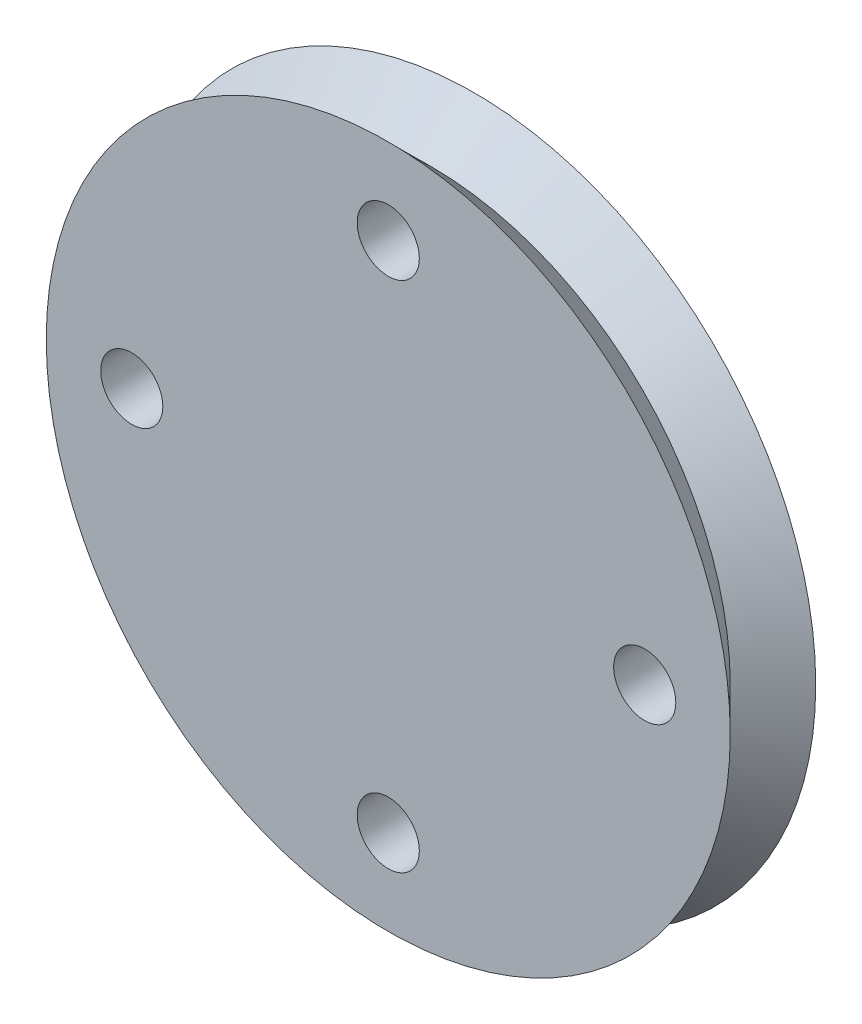
ISO-10303-21;
HEADER;
FILE_DESCRIPTION(('STEP AP214'),'2;1');
FILE_NAME('part.step','',(''),(''),'','','');
FILE_SCHEMA(('AUTOMOTIVE_DESIGN { 1 0 10303 214 1 1 1 1 }'));
ENDSEC;
DATA;
#1=APPLICATION_CONTEXT('core data for automotive mechanical design processes');
#2=APPLICATION_PROTOCOL_DEFINITION('international standard','automotive_design',2000,#1);
#3=PRODUCT_CONTEXT('',#1,'mechanical');
#4=PRODUCT('Part','Part','',(#3));
#5=PRODUCT_RELATED_PRODUCT_CATEGORY('part','',(#4));
#6=PRODUCT_DEFINITION_FORMATION('','',#4);
#7=PRODUCT_DEFINITION_CONTEXT('part definition',#1,'design');
#8=PRODUCT_DEFINITION('design','',#6,#7);
#9=PRODUCT_DEFINITION_SHAPE('','',#8);
#10=(LENGTH_UNIT() NAMED_UNIT(*) SI_UNIT(.MILLI.,.METRE.));
#11=(NAMED_UNIT(*) PLANE_ANGLE_UNIT() SI_UNIT($,.RADIAN.));
#12=(NAMED_UNIT(*) SI_UNIT($,.STERADIAN.) SOLID_ANGLE_UNIT());
#13=UNCERTAINTY_MEASURE_WITH_UNIT(LENGTH_MEASURE(1.E-05),#10,'distance_accuracy_value','');
#14=(GEOMETRIC_REPRESENTATION_CONTEXT(3) GLOBAL_UNCERTAINTY_ASSIGNED_CONTEXT((#13)) GLOBAL_UNIT_ASSIGNED_CONTEXT((#10,
#11,#12)) REPRESENTATION_CONTEXT('',''));
#15=CARTESIAN_POINT('',(0.,0.,0.));
#16=DIRECTION('',(0.,0.,1.));
#17=DIRECTION('',(1.,0.,0.));
#18=AXIS2_PLACEMENT_3D('',#15,#16,#17);
#19=CARTESIAN_POINT('',(0.,0.,2.));
#20=DIRECTION('',(0.,0.,1.));
#21=DIRECTION('',(1.,0.,0.));
#22=AXIS2_PLACEMENT_3D('',#19,#20,#21);
#23=PLANE('',#22);
#24=CARTESIAN_POINT('',(-6.,0.,2.));
#25=DIRECTION('',(0.,0.,1.));
#26=DIRECTION('',(1.,0.,0.));
#27=AXIS2_PLACEMENT_3D('',#24,#25,#26);
#28=CIRCLE('',#27,0.726422571278005);
#29=CARTESIAN_POINT('',(-5.27357742872199,0.,2.));
#30=VERTEX_POINT('',#29);
#31=EDGE_CURVE('E10',#30,#30,#28,.T.);
#32=ORIENTED_EDGE('',*,*,#31,.F.);
#33=EDGE_LOOP('',(#32));
#34=FACE_BOUND('',#33,.T.);
#35=CARTESIAN_POINT('',(0.,6.,2.));
#36=DIRECTION('',(0.,0.,1.));
#37=DIRECTION('',(1.,0.,0.));
#38=AXIS2_PLACEMENT_3D('',#35,#36,#37);
#39=CIRCLE('',#38,0.726422571278005);
#40=CARTESIAN_POINT('',(0.726422571278005,6.,2.));
#41=VERTEX_POINT('',#40);
#42=EDGE_CURVE('E46',#41,#41,#39,.T.);
#43=ORIENTED_EDGE('',*,*,#42,.F.);
#44=EDGE_LOOP('',(#43));
#45=FACE_BOUND('',#44,.T.);
#46=CARTESIAN_POINT('',(6.,0.,2.));
#47=DIRECTION('',(0.,0.,1.));
#48=DIRECTION('',(1.,0.,0.));
#49=AXIS2_PLACEMENT_3D('',#46,#47,#48);
#50=CIRCLE('',#49,0.726422571278005);
#51=CARTESIAN_POINT('',(6.72642257127801,0.,2.));
#52=VERTEX_POINT('',#51);
#53=EDGE_CURVE('E53',#52,#52,#50,.T.);
#54=ORIENTED_EDGE('',*,*,#53,.F.);
#55=EDGE_LOOP('',(#54));
#56=FACE_BOUND('',#55,.T.);
#57=CARTESIAN_POINT('',(0.,-6.,2.));
#58=DIRECTION('',(0.,0.,1.));
#59=DIRECTION('',(1.,0.,0.));
#60=AXIS2_PLACEMENT_3D('',#57,#58,#59);
#61=CIRCLE('',#60,0.726422571278006);
#62=CARTESIAN_POINT('',(0.726422571278009,-6.,2.));
#63=VERTEX_POINT('',#62);
#64=EDGE_CURVE('E37',#63,#63,#61,.T.);
#65=ORIENTED_EDGE('',*,*,#64,.F.);
#66=EDGE_LOOP('',(#65));
#67=FACE_BOUND('',#66,.T.);
#68=CARTESIAN_POINT('',(0.,0.,2.));
#69=DIRECTION('',(0.,0.,1.));
#70=DIRECTION('',(1.,0.,0.));
#71=AXIS2_PLACEMENT_3D('',#68,#69,#70);
#72=CIRCLE('',#71,8.);
#73=CARTESIAN_POINT('',(8.,0.,2.));
#74=VERTEX_POINT('',#73);
#75=EDGE_CURVE('E62',#74,#74,#72,.T.);
#76=ORIENTED_EDGE('',*,*,#75,.T.);
#77=EDGE_LOOP('',(#76));
#78=FACE_BOUND('',#77,.T.);
#79=ADVANCED_FACE('F33',(#34,#45,#56,#67,#78),#23,.T.);
#80=CARTESIAN_POINT('',(0.,0.,0.));
#81=DIRECTION('',(0.,0.,1.));
#82=DIRECTION('',(1.,0.,0.));
#83=AXIS2_PLACEMENT_3D('',#80,#81,#82);
#84=PLANE('',#83);
#85=CARTESIAN_POINT('',(-6.,0.,0.));
#86=DIRECTION('',(0.,0.,1.));
#87=DIRECTION('',(1.,0.,0.));
#88=AXIS2_PLACEMENT_3D('',#85,#86,#87);
#89=CIRCLE('',#88,0.726422571278005);
#90=CARTESIAN_POINT('',(-5.27357742872199,0.,0.));
#91=VERTEX_POINT('',#90);
#92=EDGE_CURVE('E41',#91,#91,#89,.T.);
#93=ORIENTED_EDGE('',*,*,#92,.T.);
#94=EDGE_LOOP('',(#93));
#95=FACE_BOUND('',#94,.T.);
#96=CARTESIAN_POINT('',(0.,6.,0.));
#97=DIRECTION('',(0.,0.,1.));
#98=DIRECTION('',(1.,0.,0.));
#99=AXIS2_PLACEMENT_3D('',#96,#97,#98);
#100=CIRCLE('',#99,0.726422571278005);
#101=CARTESIAN_POINT('',(0.726422571278005,6.,0.));
#102=VERTEX_POINT('',#101);
#103=EDGE_CURVE('E50',#102,#102,#100,.T.);
#104=ORIENTED_EDGE('',*,*,#103,.T.);
#105=EDGE_LOOP('',(#104));
#106=FACE_BOUND('',#105,.T.);
#107=CARTESIAN_POINT('',(6.,0.,0.));
#108=DIRECTION('',(0.,0.,1.));
#109=DIRECTION('',(1.,0.,0.));
#110=AXIS2_PLACEMENT_3D('',#107,#108,#109);
#111=CIRCLE('',#110,0.726422571278005);
#112=CARTESIAN_POINT('',(6.72642257127801,0.,0.));
#113=VERTEX_POINT('',#112);
#114=EDGE_CURVE('E56',#113,#113,#111,.T.);
#115=ORIENTED_EDGE('',*,*,#114,.T.);
#116=EDGE_LOOP('',(#115));
#117=FACE_BOUND('',#116,.T.);
#118=CARTESIAN_POINT('',(0.,-6.,0.));
#119=DIRECTION('',(0.,0.,1.));
#120=DIRECTION('',(1.,0.,0.));
#121=AXIS2_PLACEMENT_3D('',#118,#119,#120);
#122=CIRCLE('',#121,0.726422571278006);
#123=CARTESIAN_POINT('',(0.726422571278009,-6.,0.));
#124=VERTEX_POINT('',#123);
#125=EDGE_CURVE('E60',#124,#124,#122,.T.);
#126=ORIENTED_EDGE('',*,*,#125,.T.);
#127=EDGE_LOOP('',(#126));
#128=FACE_BOUND('',#127,.T.);
#129=CARTESIAN_POINT('',(0.,0.,0.));
#130=DIRECTION('',(0.,0.,1.));
#131=DIRECTION('',(1.,0.,0.));
#132=AXIS2_PLACEMENT_3D('',#129,#130,#131);
#133=CIRCLE('',#132,8.);
#134=CARTESIAN_POINT('',(8.,0.,0.));
#135=VERTEX_POINT('',#134);
#136=EDGE_CURVE('E71',#135,#135,#133,.T.);
#137=ORIENTED_EDGE('',*,*,#136,.F.);
#138=EDGE_LOOP('',(#137));
#139=FACE_BOUND('',#138,.T.);
#140=ADVANCED_FACE('F35',(#95,#106,#117,#128,#139),#84,.F.);
#141=CARTESIAN_POINT('',(0.,-6.,4.05463330463058));
#142=DIRECTION('',(0.,0.,-1.));
#143=DIRECTION('',(-1.,0.,0.));
#144=AXIS2_PLACEMENT_3D('',#141,#142,#143);
#145=CYLINDRICAL_SURFACE('',#144,0.726422571278006);
#146=ORIENTED_EDGE('',*,*,#125,.F.);
#147=EDGE_LOOP('',(#146));
#148=FACE_BOUND('',#147,.T.);
#149=ORIENTED_EDGE('',*,*,#64,.T.);
#150=EDGE_LOOP('',(#149));
#151=FACE_BOUND('',#150,.T.);
#152=ADVANCED_FACE('F81',(#148,#151),#145,.F.);
#153=CARTESIAN_POINT('',(6.,0.,4.05463330463058));
#154=DIRECTION('',(0.,0.,-1.));
#155=DIRECTION('',(-1.,0.,0.));
#156=AXIS2_PLACEMENT_3D('',#153,#154,#155);
#157=CYLINDRICAL_SURFACE('',#156,0.726422571278005);
#158=ORIENTED_EDGE('',*,*,#114,.F.);
#159=EDGE_LOOP('',(#158));
#160=FACE_BOUND('',#159,.T.);
#161=ORIENTED_EDGE('',*,*,#53,.T.);
#162=EDGE_LOOP('',(#161));
#163=FACE_BOUND('',#162,.T.);
#164=ADVANCED_FACE('F87',(#160,#163),#157,.F.);
#165=CARTESIAN_POINT('',(0.,6.,4.05463330463058));
#166=DIRECTION('',(0.,0.,-1.));
#167=DIRECTION('',(-1.,0.,0.));
#168=AXIS2_PLACEMENT_3D('',#165,#166,#167);
#169=CYLINDRICAL_SURFACE('',#168,0.726422571278005);
#170=ORIENTED_EDGE('',*,*,#103,.F.);
#171=EDGE_LOOP('',(#170));
#172=FACE_BOUND('',#171,.T.);
#173=ORIENTED_EDGE('',*,*,#42,.T.);
#174=EDGE_LOOP('',(#173));
#175=FACE_BOUND('',#174,.T.);
#176=ADVANCED_FACE('F99',(#172,#175),#169,.F.);
#177=CARTESIAN_POINT('',(-6.,0.,4.05463330463058));
#178=DIRECTION('',(0.,0.,-1.));
#179=DIRECTION('',(-1.,0.,0.));
#180=AXIS2_PLACEMENT_3D('',#177,#178,#179);
#181=CYLINDRICAL_SURFACE('',#180,0.726422571278005);
#182=ORIENTED_EDGE('',*,*,#92,.F.);
#183=EDGE_LOOP('',(#182));
#184=FACE_BOUND('',#183,.T.);
#185=ORIENTED_EDGE('',*,*,#31,.T.);
#186=EDGE_LOOP('',(#185));
#187=FACE_BOUND('',#186,.T.);
#188=ADVANCED_FACE('F109',(#184,#187),#181,.F.);
#189=CARTESIAN_POINT('',(0.,0.,2.));
#190=DIRECTION('',(0.,0.,1.));
#191=DIRECTION('',(1.,0.,0.));
#192=AXIS2_PLACEMENT_3D('',#189,#190,#191);
#193=CONICAL_SURFACE('',#192,8.,0.785398163397448);
#194=CARTESIAN_POINT('',(0.,0.,0.999999999999997));
#195=DIRECTION('',(0.,0.,1.));
#196=DIRECTION('',(1.,0.,0.));
#197=AXIS2_PLACEMENT_3D('',#194,#195,#196);
#198=CIRCLE('',#197,7.);
#199=CARTESIAN_POINT('',(7.,0.,0.999999999999997));
#200=VERTEX_POINT('',#199);
#201=EDGE_CURVE('E67',#200,#200,#198,.T.);
#202=ORIENTED_EDGE('',*,*,#201,.T.);
#203=EDGE_LOOP('',(#202));
#204=FACE_BOUND('',#203,.T.);
#205=ORIENTED_EDGE('',*,*,#75,.F.);
#206=EDGE_LOOP('',(#205));
#207=FACE_BOUND('',#206,.T.);
#208=ADVANCED_FACE('F115',(#204,#207),#193,.T.);
#209=CARTESIAN_POINT('',(0.,0.,0.999999999999997));
#210=DIRECTION('',(0.,0.,-1.));
#211=DIRECTION('',(-1.,0.,0.));
#212=AXIS2_PLACEMENT_3D('',#209,#210,#211);
#213=CONICAL_SURFACE('',#212,7.,0.785398163397452);
#214=ORIENTED_EDGE('',*,*,#136,.T.);
#215=EDGE_LOOP('',(#214));
#216=FACE_BOUND('',#215,.T.);
#217=ORIENTED_EDGE('',*,*,#201,.F.);
#218=EDGE_LOOP('',(#217));
#219=FACE_BOUND('',#218,.T.);
#220=ADVANCED_FACE('F77',(#216,#219),#213,.T.);
#221=CLOSED_SHELL('',(#79,#140,#152,#164,#176,#188,#208,#220));
#222=MANIFOLD_SOLID_BREP('B2',#221);
#223=ADVANCED_BREP_SHAPE_REPRESENTATION('',(#18,#222),#14);
#224=SHAPE_DEFINITION_REPRESENTATION(#9,#223);
ENDSEC;
END-ISO-10303-21;
